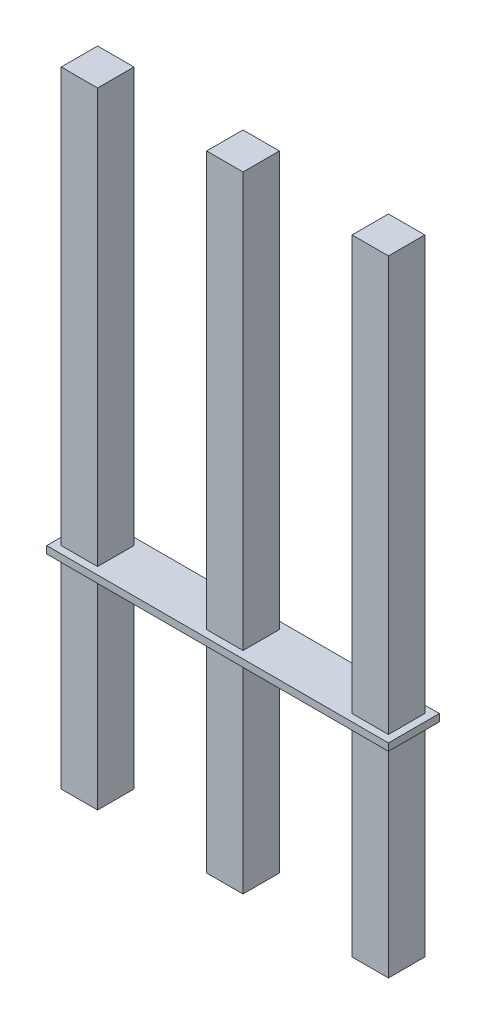
ISO-10303-21;
HEADER;
FILE_DESCRIPTION(('STEP AP214'),'2;1');
FILE_NAME('part.step','',(''),(''),'','','');
FILE_SCHEMA(('AUTOMOTIVE_DESIGN { 1 0 10303 214 1 1 1 1 }'));
ENDSEC;
DATA;
#1=APPLICATION_CONTEXT('core data for automotive mechanical design processes');
#2=APPLICATION_PROTOCOL_DEFINITION('international standard','automotive_design',2000,#1);
#3=PRODUCT_CONTEXT('',#1,'mechanical');
#4=PRODUCT('Part','Part','',(#3));
#5=PRODUCT_RELATED_PRODUCT_CATEGORY('part','',(#4));
#6=PRODUCT_DEFINITION_FORMATION('','',#4);
#7=PRODUCT_DEFINITION_CONTEXT('part definition',#1,'design');
#8=PRODUCT_DEFINITION('design','',#6,#7);
#9=PRODUCT_DEFINITION_SHAPE('','',#8);
#10=(LENGTH_UNIT() NAMED_UNIT(*) SI_UNIT(.MILLI.,.METRE.));
#11=(NAMED_UNIT(*) PLANE_ANGLE_UNIT() SI_UNIT($,.RADIAN.));
#12=(NAMED_UNIT(*) SI_UNIT($,.STERADIAN.) SOLID_ANGLE_UNIT());
#13=UNCERTAINTY_MEASURE_WITH_UNIT(LENGTH_MEASURE(1.E-05),#10,'distance_accuracy_value','');
#14=(GEOMETRIC_REPRESENTATION_CONTEXT(3) GLOBAL_UNCERTAINTY_ASSIGNED_CONTEXT((#13)) GLOBAL_UNIT_ASSIGNED_CONTEXT((#10,
#11,#12)) REPRESENTATION_CONTEXT('',''));
#15=CARTESIAN_POINT('',(0.,0.,0.));
#16=DIRECTION('',(0.,0.,1.));
#17=DIRECTION('',(1.,0.,0.));
#18=AXIS2_PLACEMENT_3D('',#15,#16,#17);
#19=CARTESIAN_POINT('',(2.2225,-7.366,2.54));
#20=DIRECTION('',(-1.,0.,0.));
#21=DIRECTION('',(0.,0.,1.));
#22=AXIS2_PLACEMENT_3D('',#19,#20,#21);
#23=PLANE('',#22);
#24=DIRECTION('',(0.,-1.,0.));
#25=VECTOR('',#24,1.);
#26=CARTESIAN_POINT('',(2.2225,0.,-0.3175));
#27=LINE('',#26,#25);
#28=CARTESIAN_POINT('',(2.2225,3.556,-0.3175));
#29=VERTEX_POINT('',#28);
#30=CARTESIAN_POINT('',(2.2225,0.,-0.3175));
#31=VERTEX_POINT('',#30);
#32=EDGE_CURVE('E10',#29,#31,#27,.T.);
#33=ORIENTED_EDGE('',*,*,#32,.T.);
#34=DIRECTION('',(0.,0.,1.));
#35=VECTOR('',#34,1.);
#36=CARTESIAN_POINT('',(2.2225,0.,0.3175));
#37=LINE('',#36,#35);
#38=CARTESIAN_POINT('',(2.2225,0.,0.3175));
#39=VERTEX_POINT('',#38);
#40=EDGE_CURVE('E24',#31,#39,#37,.T.);
#41=ORIENTED_EDGE('',*,*,#40,.T.);
#42=DIRECTION('',(0.,-1.,0.));
#43=VECTOR('',#42,1.);
#44=CARTESIAN_POINT('',(2.2225,0.,0.3175));
#45=LINE('',#44,#43);
#46=CARTESIAN_POINT('',(2.2225,3.556,0.3175));
#47=VERTEX_POINT('',#46);
#48=EDGE_CURVE('E581',#47,#39,#45,.T.);
#49=ORIENTED_EDGE('',*,*,#48,.F.);
#50=DIRECTION('',(0.,0.,-1.));
#51=VECTOR('',#50,1.);
#52=CARTESIAN_POINT('',(2.2225,3.556,2.54));
#53=LINE('',#52,#51);
#54=EDGE_CURVE('E577',#47,#29,#53,.T.);
#55=ORIENTED_EDGE('',*,*,#54,.T.);
#56=EDGE_LOOP('',(#33,#41,#49,#55));
#57=FACE_BOUND('',#56,.T.);
#58=ADVANCED_FACE('F16',(#57),#23,.T.);
#59=CARTESIAN_POINT('',(2.9845,3.556,0.4445));
#60=DIRECTION('',(0.,1.,0.));
#61=DIRECTION('',(0.,0.,1.));
#62=AXIS2_PLACEMENT_3D('',#59,#60,#61);
#63=PLANE('',#62);
#64=DIRECTION('',(-1.,0.,0.));
#65=VECTOR('',#64,1.);
#66=CARTESIAN_POINT('',(0.,3.556,0.3175));
#67=LINE('',#66,#65);
#68=CARTESIAN_POINT('',(-2.2225,3.556,0.3175));
#69=VERTEX_POINT('',#68);
#70=CARTESIAN_POINT('',(-2.8575,3.556,0.3175));
#71=VERTEX_POINT('',#70);
#72=EDGE_CURVE('E572',#69,#71,#67,.T.);
#73=ORIENTED_EDGE('',*,*,#72,.F.);
#74=DIRECTION('',(0.,0.,-1.));
#75=VECTOR('',#74,1.);
#76=CARTESIAN_POINT('',(-2.2225,3.556,2.54));
#77=LINE('',#76,#75);
#78=CARTESIAN_POINT('',(-2.2225,3.556,-0.3175));
#79=VERTEX_POINT('',#78);
#80=EDGE_CURVE('E568',#69,#79,#77,.T.);
#81=ORIENTED_EDGE('',*,*,#80,.T.);
#82=DIRECTION('',(-1.,0.,0.));
#83=VECTOR('',#82,1.);
#84=CARTESIAN_POINT('',(0.,3.556,-0.3175));
#85=LINE('',#84,#83);
#86=CARTESIAN_POINT('',(-2.8575,3.556,-0.3175));
#87=VERTEX_POINT('',#86);
#88=EDGE_CURVE('E219',#79,#87,#85,.T.);
#89=ORIENTED_EDGE('',*,*,#88,.T.);
#90=DIRECTION('',(0.,0.,1.));
#91=VECTOR('',#90,1.);
#92=CARTESIAN_POINT('',(-2.8575,3.556,0.3175));
#93=LINE('',#92,#91);
#94=EDGE_CURVE('E561',#87,#71,#93,.T.);
#95=ORIENTED_EDGE('',*,*,#94,.T.);
#96=EDGE_LOOP('',(#73,#81,#89,#95));
#97=FACE_BOUND('',#96,.T.);
#98=DIRECTION('',(-1.,0.,0.));
#99=VECTOR('',#98,1.);
#100=CARTESIAN_POINT('',(0.,3.556,-0.3175));
#101=LINE('',#100,#99);
#102=CARTESIAN_POINT('',(2.8575,3.556,-0.3175));
#103=VERTEX_POINT('',#102);
#104=EDGE_CURVE('E556',#103,#29,#101,.T.);
#105=ORIENTED_EDGE('',*,*,#104,.T.);
#106=ORIENTED_EDGE('',*,*,#54,.F.);
#107=DIRECTION('',(-1.,0.,0.));
#108=VECTOR('',#107,1.);
#109=CARTESIAN_POINT('',(0.,3.556,0.3175));
#110=LINE('',#109,#108);
#111=CARTESIAN_POINT('',(2.8575,3.556,0.3175));
#112=VERTEX_POINT('',#111);
#113=EDGE_CURVE('E551',#112,#47,#110,.T.);
#114=ORIENTED_EDGE('',*,*,#113,.F.);
#115=DIRECTION('',(0.,0.,-1.));
#116=VECTOR('',#115,1.);
#117=CARTESIAN_POINT('',(2.8575,3.556,0.3175));
#118=LINE('',#117,#116);
#119=EDGE_CURVE('E547',#112,#103,#118,.T.);
#120=ORIENTED_EDGE('',*,*,#119,.T.);
#121=EDGE_LOOP('',(#105,#106,#114,#120));
#122=FACE_BOUND('',#121,.T.);
#123=DIRECTION('',(-1.,0.,0.));
#124=VECTOR('',#123,1.);
#125=CARTESIAN_POINT('',(0.,3.556,0.3175));
#126=LINE('',#125,#124);
#127=CARTESIAN_POINT('',(0.3175,3.556,0.3175));
#128=VERTEX_POINT('',#127);
#129=CARTESIAN_POINT('',(-0.3175,3.556,0.3175));
#130=VERTEX_POINT('',#129);
#131=EDGE_CURVE('E542',#128,#130,#126,.T.);
#132=ORIENTED_EDGE('',*,*,#131,.F.);
#133=DIRECTION('',(0.,0.,-1.));
#134=VECTOR('',#133,1.);
#135=CARTESIAN_POINT('',(0.3175,3.556,2.54));
#136=LINE('',#135,#134);
#137=CARTESIAN_POINT('',(0.3175,3.556,-0.3175));
#138=VERTEX_POINT('',#137);
#139=EDGE_CURVE('E538',#128,#138,#136,.T.);
#140=ORIENTED_EDGE('',*,*,#139,.T.);
#141=DIRECTION('',(-1.,0.,0.));
#142=VECTOR('',#141,1.);
#143=CARTESIAN_POINT('',(0.,3.556,-0.3175));
#144=LINE('',#143,#142);
#145=CARTESIAN_POINT('',(-0.3175,3.556,-0.3175));
#146=VERTEX_POINT('',#145);
#147=EDGE_CURVE('E534',#138,#146,#144,.T.);
#148=ORIENTED_EDGE('',*,*,#147,.T.);
#149=DIRECTION('',(0.,0.,-1.));
#150=VECTOR('',#149,1.);
#151=CARTESIAN_POINT('',(-0.3175,3.556,2.54));
#152=LINE('',#151,#150);
#153=EDGE_CURVE('E529',#130,#146,#152,.T.);
#154=ORIENTED_EDGE('',*,*,#153,.F.);
#155=EDGE_LOOP('',(#132,#140,#148,#154));
#156=FACE_BOUND('',#155,.T.);
#157=DIRECTION('',(0.,0.,-1.));
#158=VECTOR('',#157,1.);
#159=CARTESIAN_POINT('',(-2.9845,3.556,0.4445));
#160=LINE('',#159,#158);
#161=CARTESIAN_POINT('',(-2.9845,3.556,0.4445));
#162=VERTEX_POINT('',#161);
#163=CARTESIAN_POINT('',(-2.9845,3.556,-0.4445));
#164=VERTEX_POINT('',#163);
#165=EDGE_CURVE('E525',#162,#164,#160,.T.);
#166=ORIENTED_EDGE('',*,*,#165,.T.);
#167=DIRECTION('',(-1.,0.,0.));
#168=VECTOR('',#167,1.);
#169=CARTESIAN_POINT('',(2.9845,3.556,-0.4445));
#170=LINE('',#169,#168);
#171=CARTESIAN_POINT('',(2.9845,3.556,-0.4445));
#172=VERTEX_POINT('',#171);
#173=EDGE_CURVE('E520',#172,#164,#170,.T.);
#174=ORIENTED_EDGE('',*,*,#173,.F.);
#175=DIRECTION('',(0.,0.,-1.));
#176=VECTOR('',#175,1.);
#177=CARTESIAN_POINT('',(2.9845,3.556,0.4445));
#178=LINE('',#177,#176);
#179=CARTESIAN_POINT('',(2.9845,3.556,0.4445));
#180=VERTEX_POINT('',#179);
#181=EDGE_CURVE('E515',#180,#172,#178,.T.);
#182=ORIENTED_EDGE('',*,*,#181,.F.);
#183=DIRECTION('',(-1.,0.,0.));
#184=VECTOR('',#183,1.);
#185=CARTESIAN_POINT('',(2.9845,3.556,0.4445));
#186=LINE('',#185,#184);
#187=EDGE_CURVE('E511',#180,#162,#186,.T.);
#188=ORIENTED_EDGE('',*,*,#187,.T.);
#189=EDGE_LOOP('',(#166,#174,#182,#188));
#190=FACE_BOUND('',#189,.T.);
#191=ADVANCED_FACE('F594',(#97,#122,#156,#190),#63,.F.);
#192=CARTESIAN_POINT('',(2.9845,3.683,0.4445));
#193=DIRECTION('',(0.,0.,-1.));
#194=DIRECTION('',(-1.,0.,0.));
#195=AXIS2_PLACEMENT_3D('',#192,#193,#194);
#196=PLANE('',#195);
#197=DIRECTION('',(0.,-1.,0.));
#198=VECTOR('',#197,1.);
#199=CARTESIAN_POINT('',(-2.9845,3.683,0.4445));
#200=LINE('',#199,#198);
#201=CARTESIAN_POINT('',(-2.9845,3.683,0.4445));
#202=VERTEX_POINT('',#201);
#203=EDGE_CURVE('E506',#202,#162,#200,.T.);
#204=ORIENTED_EDGE('',*,*,#203,.T.);
#205=ORIENTED_EDGE('',*,*,#187,.F.);
#206=DIRECTION('',(0.,-1.,0.));
#207=VECTOR('',#206,1.);
#208=CARTESIAN_POINT('',(2.9845,3.683,0.4445));
#209=LINE('',#208,#207);
#210=CARTESIAN_POINT('',(2.9845,3.683,0.4445));
#211=VERTEX_POINT('',#210);
#212=EDGE_CURVE('E501',#211,#180,#209,.T.);
#213=ORIENTED_EDGE('',*,*,#212,.F.);
#214=DIRECTION('',(-1.,0.,0.));
#215=VECTOR('',#214,1.);
#216=CARTESIAN_POINT('',(2.9845,3.683,0.4445));
#217=LINE('',#216,#215);
#218=EDGE_CURVE('E497',#211,#202,#217,.T.);
#219=ORIENTED_EDGE('',*,*,#218,.T.);
#220=EDGE_LOOP('',(#204,#205,#213,#219));
#221=FACE_BOUND('',#220,.T.);
#222=ADVANCED_FACE('F622',(#221),#196,.F.);
#223=CARTESIAN_POINT('',(2.9845,3.683,-0.4445));
#224=DIRECTION('',(0.,-1.,0.));
#225=DIRECTION('',(0.,0.,-1.));
#226=AXIS2_PLACEMENT_3D('',#223,#224,#225);
#227=PLANE('',#226);
#228=DIRECTION('',(0.,0.,-1.));
#229=VECTOR('',#228,1.);
#230=CARTESIAN_POINT('',(-2.2225,3.683,2.54));
#231=LINE('',#230,#229);
#232=CARTESIAN_POINT('',(-2.2225,3.683,0.3175));
#233=VERTEX_POINT('',#232);
#234=CARTESIAN_POINT('',(-2.2225,3.683,-0.3175));
#235=VERTEX_POINT('',#234);
#236=EDGE_CURVE('E492',#233,#235,#231,.T.);
#237=ORIENTED_EDGE('',*,*,#236,.F.);
#238=DIRECTION('',(1.,0.,0.));
#239=VECTOR('',#238,1.);
#240=CARTESIAN_POINT('',(0.,3.683,0.3175));
#241=LINE('',#240,#239);
#242=CARTESIAN_POINT('',(-2.8575,3.683,0.3175));
#243=VERTEX_POINT('',#242);
#244=EDGE_CURVE('E487',#243,#233,#241,.T.);
#245=ORIENTED_EDGE('',*,*,#244,.F.);
#246=DIRECTION('',(0.,0.,-1.));
#247=VECTOR('',#246,1.);
#248=CARTESIAN_POINT('',(-2.8575,3.683,0.3175));
#249=LINE('',#248,#247);
#250=CARTESIAN_POINT('',(-2.8575,3.683,-0.3175));
#251=VERTEX_POINT('',#250);
#252=EDGE_CURVE('E483',#243,#251,#249,.T.);
#253=ORIENTED_EDGE('',*,*,#252,.T.);
#254=DIRECTION('',(1.,0.,0.));
#255=VECTOR('',#254,1.);
#256=CARTESIAN_POINT('',(0.,3.683,-0.3175));
#257=LINE('',#256,#255);
#258=EDGE_CURVE('E479',#251,#235,#257,.T.);
#259=ORIENTED_EDGE('',*,*,#258,.T.);
#260=EDGE_LOOP('',(#237,#245,#253,#259));
#261=FACE_BOUND('',#260,.T.);
#262=DIRECTION('',(0.,0.,-1.));
#263=VECTOR('',#262,1.);
#264=CARTESIAN_POINT('',(0.3175,3.683,2.54));
#265=LINE('',#264,#263);
#266=CARTESIAN_POINT('',(0.3175,3.683,0.3175));
#267=VERTEX_POINT('',#266);
#268=CARTESIAN_POINT('',(0.3175,3.683,-0.3175));
#269=VERTEX_POINT('',#268);
#270=EDGE_CURVE('E474',#267,#269,#265,.T.);
#271=ORIENTED_EDGE('',*,*,#270,.F.);
#272=DIRECTION('',(1.,0.,0.));
#273=VECTOR('',#272,1.);
#274=CARTESIAN_POINT('',(0.,3.683,0.3175));
#275=LINE('',#274,#273);
#276=CARTESIAN_POINT('',(-0.3175,3.683,0.3175));
#277=VERTEX_POINT('',#276);
#278=EDGE_CURVE('E469',#277,#267,#275,.T.);
#279=ORIENTED_EDGE('',*,*,#278,.F.);
#280=DIRECTION('',(0.,0.,-1.));
#281=VECTOR('',#280,1.);
#282=CARTESIAN_POINT('',(-0.3175,3.683,2.54));
#283=LINE('',#282,#281);
#284=CARTESIAN_POINT('',(-0.3175,3.683,-0.3175));
#285=VERTEX_POINT('',#284);
#286=EDGE_CURVE('E465',#277,#285,#283,.T.);
#287=ORIENTED_EDGE('',*,*,#286,.T.);
#288=DIRECTION('',(1.,0.,0.));
#289=VECTOR('',#288,1.);
#290=CARTESIAN_POINT('',(0.,3.683,-0.3175));
#291=LINE('',#290,#289);
#292=EDGE_CURVE('E461',#285,#269,#291,.T.);
#293=ORIENTED_EDGE('',*,*,#292,.T.);
#294=EDGE_LOOP('',(#271,#279,#287,#293));
#295=FACE_BOUND('',#294,.T.);
#296=DIRECTION('',(1.,0.,0.));
#297=VECTOR('',#296,1.);
#298=CARTESIAN_POINT('',(0.,3.683,0.3175));
#299=LINE('',#298,#297);
#300=CARTESIAN_POINT('',(2.2225,3.683,0.3175));
#301=VERTEX_POINT('',#300);
#302=CARTESIAN_POINT('',(2.8575,3.683,0.3175));
#303=VERTEX_POINT('',#302);
#304=EDGE_CURVE('E456',#301,#303,#299,.T.);
#305=ORIENTED_EDGE('',*,*,#304,.F.);
#306=DIRECTION('',(0.,0.,-1.));
#307=VECTOR('',#306,1.);
#308=CARTESIAN_POINT('',(2.2225,3.683,2.54));
#309=LINE('',#308,#307);
#310=CARTESIAN_POINT('',(2.2225,3.683,-0.3175));
#311=VERTEX_POINT('',#310);
#312=EDGE_CURVE('E452',#301,#311,#309,.T.);
#313=ORIENTED_EDGE('',*,*,#312,.T.);
#314=DIRECTION('',(1.,0.,0.));
#315=VECTOR('',#314,1.);
#316=CARTESIAN_POINT('',(0.,3.683,-0.3175));
#317=LINE('',#316,#315);
#318=CARTESIAN_POINT('',(2.8575,3.683,-0.3175));
#319=VERTEX_POINT('',#318);
#320=EDGE_CURVE('E448',#311,#319,#317,.T.);
#321=ORIENTED_EDGE('',*,*,#320,.T.);
#322=DIRECTION('',(0.,0.,1.));
#323=VECTOR('',#322,1.);
#324=CARTESIAN_POINT('',(2.8575,3.683,0.3175));
#325=LINE('',#324,#323);
#326=EDGE_CURVE('E444',#319,#303,#325,.T.);
#327=ORIENTED_EDGE('',*,*,#326,.T.);
#328=EDGE_LOOP('',(#305,#313,#321,#327));
#329=FACE_BOUND('',#328,.T.);
#330=DIRECTION('',(-1.,0.,0.));
#331=VECTOR('',#330,1.);
#332=CARTESIAN_POINT('',(2.9845,3.683,-0.4445));
#333=LINE('',#332,#331);
#334=CARTESIAN_POINT('',(2.9845,3.683,-0.4445));
#335=VERTEX_POINT('',#334);
#336=CARTESIAN_POINT('',(-2.9845,3.683,-0.4445));
#337=VERTEX_POINT('',#336);
#338=EDGE_CURVE('E440',#335,#337,#333,.T.);
#339=ORIENTED_EDGE('',*,*,#338,.T.);
#340=DIRECTION('',(0.,0.,1.));
#341=VECTOR('',#340,1.);
#342=CARTESIAN_POINT('',(-2.9845,3.683,-0.4445));
#343=LINE('',#342,#341);
#344=EDGE_CURVE('E435',#337,#202,#343,.T.);
#345=ORIENTED_EDGE('',*,*,#344,.T.);
#346=ORIENTED_EDGE('',*,*,#218,.F.);
#347=DIRECTION('',(0.,0.,1.));
#348=VECTOR('',#347,1.);
#349=CARTESIAN_POINT('',(2.9845,3.683,-0.4445));
#350=LINE('',#349,#348);
#351=EDGE_CURVE('E430',#335,#211,#350,.T.);
#352=ORIENTED_EDGE('',*,*,#351,.F.);
#353=EDGE_LOOP('',(#339,#345,#346,#352));
#354=FACE_BOUND('',#353,.T.);
#355=ADVANCED_FACE('F627',(#261,#295,#329,#354),#227,.F.);
#356=CARTESIAN_POINT('',(2.9845,0.,0.));
#357=DIRECTION('',(1.,0.,0.));
#358=DIRECTION('',(0.,0.,-1.));
#359=AXIS2_PLACEMENT_3D('',#356,#357,#358);
#360=PLANE('',#359);
#361=ORIENTED_EDGE('',*,*,#351,.T.);
#362=ORIENTED_EDGE('',*,*,#212,.T.);
#363=ORIENTED_EDGE('',*,*,#181,.T.);
#364=DIRECTION('',(0.,1.,0.));
#365=VECTOR('',#364,1.);
#366=CARTESIAN_POINT('',(2.9845,3.556,-0.4445));
#367=LINE('',#366,#365);
#368=EDGE_CURVE('E425',#172,#335,#367,.T.);
#369=ORIENTED_EDGE('',*,*,#368,.T.);
#370=EDGE_LOOP('',(#361,#362,#363,#369));
#371=FACE_BOUND('',#370,.T.);
#372=ADVANCED_FACE('F633',(#371),#360,.T.);
#373=CARTESIAN_POINT('',(2.9845,3.556,-0.4445));
#374=DIRECTION('',(0.,0.,1.));
#375=DIRECTION('',(1.,0.,0.));
#376=AXIS2_PLACEMENT_3D('',#373,#374,#375);
#377=PLANE('',#376);
#378=DIRECTION('',(0.,1.,0.));
#379=VECTOR('',#378,1.);
#380=CARTESIAN_POINT('',(-2.9845,3.556,-0.4445));
#381=LINE('',#380,#379);
#382=EDGE_CURVE('E420',#164,#337,#381,.T.);
#383=ORIENTED_EDGE('',*,*,#382,.T.);
#384=ORIENTED_EDGE('',*,*,#338,.F.);
#385=ORIENTED_EDGE('',*,*,#368,.F.);
#386=ORIENTED_EDGE('',*,*,#173,.T.);
#387=EDGE_LOOP('',(#383,#384,#385,#386));
#388=FACE_BOUND('',#387,.T.);
#389=ADVANCED_FACE('F637',(#388),#377,.F.);
#390=CARTESIAN_POINT('',(-2.9845,0.,0.));
#391=DIRECTION('',(1.,0.,0.));
#392=DIRECTION('',(0.,0.,-1.));
#393=AXIS2_PLACEMENT_3D('',#390,#391,#392);
#394=PLANE('',#393);
#395=ORIENTED_EDGE('',*,*,#344,.F.);
#396=ORIENTED_EDGE('',*,*,#382,.F.);
#397=ORIENTED_EDGE('',*,*,#165,.F.);
#398=ORIENTED_EDGE('',*,*,#203,.F.);
#399=EDGE_LOOP('',(#395,#396,#397,#398));
#400=FACE_BOUND('',#399,.T.);
#401=ADVANCED_FACE('F641',(#400),#394,.F.);
#402=CARTESIAN_POINT('',(2.8575,0.,0.3175));
#403=DIRECTION('',(-1.,0.,0.));
#404=DIRECTION('',(0.,0.,1.));
#405=AXIS2_PLACEMENT_3D('',#402,#403,#404);
#406=PLANE('',#405);
#407=ORIENTED_EDGE('',*,*,#326,.F.);
#408=DIRECTION('',(0.,1.,0.));
#409=VECTOR('',#408,1.);
#410=CARTESIAN_POINT('',(2.8575,0.,-0.3175));
#411=LINE('',#410,#409);
#412=CARTESIAN_POINT('',(2.8575,10.922,-0.3175));
#413=VERTEX_POINT('',#412);
#414=EDGE_CURVE('E416',#319,#413,#411,.T.);
#415=ORIENTED_EDGE('',*,*,#414,.T.);
#416=DIRECTION('',(0.,0.,-1.));
#417=VECTOR('',#416,1.);
#418=CARTESIAN_POINT('',(2.8575,10.922,0.3175));
#419=LINE('',#418,#417);
#420=CARTESIAN_POINT('',(2.8575,10.922,0.3175));
#421=VERTEX_POINT('',#420);
#422=EDGE_CURVE('E411',#421,#413,#419,.T.);
#423=ORIENTED_EDGE('',*,*,#422,.F.);
#424=DIRECTION('',(0.,1.,0.));
#425=VECTOR('',#424,1.);
#426=CARTESIAN_POINT('',(2.8575,0.,0.3175));
#427=LINE('',#426,#425);
#428=EDGE_CURVE('E406',#303,#421,#427,.T.);
#429=ORIENTED_EDGE('',*,*,#428,.F.);
#430=EDGE_LOOP('',(#407,#415,#423,#429));
#431=FACE_BOUND('',#430,.T.);
#432=ADVANCED_FACE('F645',(#431),#406,.F.);
#433=CARTESIAN_POINT('',(0.,0.,0.3175));
#434=DIRECTION('',(0.,0.,1.));
#435=DIRECTION('',(1.,0.,0.));
#436=AXIS2_PLACEMENT_3D('',#433,#434,#435);
#437=PLANE('',#436);
#438=DIRECTION('',(-1.,0.,0.));
#439=VECTOR('',#438,1.);
#440=CARTESIAN_POINT('',(2.8575,10.922,0.3175));
#441=LINE('',#440,#439);
#442=CARTESIAN_POINT('',(2.2225,10.922,0.3175));
#443=VERTEX_POINT('',#442);
#444=EDGE_CURVE('E402',#421,#443,#441,.T.);
#445=ORIENTED_EDGE('',*,*,#444,.T.);
#446=DIRECTION('',(0.,-1.,0.));
#447=VECTOR('',#446,1.);
#448=CARTESIAN_POINT('',(2.2225,0.,0.3175));
#449=LINE('',#448,#447);
#450=EDGE_CURVE('E397',#443,#301,#449,.T.);
#451=ORIENTED_EDGE('',*,*,#450,.T.);
#452=ORIENTED_EDGE('',*,*,#304,.T.);
#453=ORIENTED_EDGE('',*,*,#428,.T.);
#454=EDGE_LOOP('',(#445,#451,#452,#453));
#455=FACE_BOUND('',#454,.T.);
#456=ADVANCED_FACE('F649',(#455),#437,.T.);
#457=CARTESIAN_POINT('',(2.2225,3.683,2.54));
#458=DIRECTION('',(-1.,0.,0.));
#459=DIRECTION('',(0.,0.,1.));
#460=AXIS2_PLACEMENT_3D('',#457,#458,#459);
#461=PLANE('',#460);
#462=DIRECTION('',(0.,0.,-1.));
#463=VECTOR('',#462,1.);
#464=CARTESIAN_POINT('',(2.2225,10.922,0.3175));
#465=LINE('',#464,#463);
#466=CARTESIAN_POINT('',(2.2225,10.922,-0.3175));
#467=VERTEX_POINT('',#466);
#468=EDGE_CURVE('E393',#443,#467,#465,.T.);
#469=ORIENTED_EDGE('',*,*,#468,.T.);
#470=DIRECTION('',(0.,-1.,0.));
#471=VECTOR('',#470,1.);
#472=CARTESIAN_POINT('',(2.2225,0.,-0.3175));
#473=LINE('',#472,#471);
#474=EDGE_CURVE('E388',#467,#311,#473,.T.);
#475=ORIENTED_EDGE('',*,*,#474,.T.);
#476=ORIENTED_EDGE('',*,*,#312,.F.);
#477=ORIENTED_EDGE('',*,*,#450,.F.);
#478=EDGE_LOOP('',(#469,#475,#476,#477));
#479=FACE_BOUND('',#478,.T.);
#480=ADVANCED_FACE('F653',(#479),#461,.T.);
#481=CARTESIAN_POINT('',(0.,0.,-0.3175));
#482=DIRECTION('',(0.,0.,1.));
#483=DIRECTION('',(1.,0.,0.));
#484=AXIS2_PLACEMENT_3D('',#481,#482,#483);
#485=PLANE('',#484);
#486=ORIENTED_EDGE('',*,*,#474,.F.);
#487=DIRECTION('',(-1.,0.,0.));
#488=VECTOR('',#487,1.);
#489=CARTESIAN_POINT('',(2.8575,10.922,-0.3175));
#490=LINE('',#489,#488);
#491=EDGE_CURVE('E383',#413,#467,#490,.T.);
#492=ORIENTED_EDGE('',*,*,#491,.F.);
#493=ORIENTED_EDGE('',*,*,#414,.F.);
#494=ORIENTED_EDGE('',*,*,#320,.F.);
#495=EDGE_LOOP('',(#486,#492,#493,#494));
#496=FACE_BOUND('',#495,.T.);
#497=ADVANCED_FACE('F657',(#496),#485,.F.);
#498=CARTESIAN_POINT('',(2.8575,10.922,0.3175));
#499=DIRECTION('',(0.,-1.,0.));
#500=DIRECTION('',(0.,0.,-1.));
#501=AXIS2_PLACEMENT_3D('',#498,#499,#500);
#502=PLANE('',#501);
#503=ORIENTED_EDGE('',*,*,#468,.F.);
#504=ORIENTED_EDGE('',*,*,#444,.F.);
#505=ORIENTED_EDGE('',*,*,#422,.T.);
#506=ORIENTED_EDGE('',*,*,#491,.T.);
#507=EDGE_LOOP('',(#503,#504,#505,#506));
#508=FACE_BOUND('',#507,.T.);
#509=ADVANCED_FACE('F661',(#508),#502,.F.);
#510=CARTESIAN_POINT('',(0.,0.,-0.3175));
#511=DIRECTION('',(0.,0.,1.));
#512=DIRECTION('',(1.,0.,0.));
#513=AXIS2_PLACEMENT_3D('',#510,#511,#512);
#514=PLANE('',#513);
#515=DIRECTION('',(0.,-1.,0.));
#516=VECTOR('',#515,1.);
#517=CARTESIAN_POINT('',(-0.3175,0.,-0.3175));
#518=LINE('',#517,#516);
#519=CARTESIAN_POINT('',(-0.3175,10.922,-0.3175));
#520=VERTEX_POINT('',#519);
#521=EDGE_CURVE('E378',#520,#285,#518,.T.);
#522=ORIENTED_EDGE('',*,*,#521,.F.);
#523=DIRECTION('',(-1.,0.,0.));
#524=VECTOR('',#523,1.);
#525=CARTESIAN_POINT('',(2.8575,10.922,-0.3175));
#526=LINE('',#525,#524);
#527=CARTESIAN_POINT('',(0.3175,10.922,-0.3175));
#528=VERTEX_POINT('',#527);
#529=EDGE_CURVE('E373',#528,#520,#526,.T.);
#530=ORIENTED_EDGE('',*,*,#529,.F.);
#531=DIRECTION('',(0.,1.,0.));
#532=VECTOR('',#531,1.);
#533=CARTESIAN_POINT('',(0.3175,0.,-0.3175));
#534=LINE('',#533,#532);
#535=EDGE_CURVE('E368',#269,#528,#534,.T.);
#536=ORIENTED_EDGE('',*,*,#535,.F.);
#537=ORIENTED_EDGE('',*,*,#292,.F.);
#538=EDGE_LOOP('',(#522,#530,#536,#537));
#539=FACE_BOUND('',#538,.T.);
#540=ADVANCED_FACE('F665',(#539),#514,.F.);
#541=CARTESIAN_POINT('',(0.3175,10.922,2.54));
#542=DIRECTION('',(1.,0.,0.));
#543=DIRECTION('',(0.,0.,-1.));
#544=AXIS2_PLACEMENT_3D('',#541,#542,#543);
#545=PLANE('',#544);
#546=ORIENTED_EDGE('',*,*,#270,.T.);
#547=ORIENTED_EDGE('',*,*,#535,.T.);
#548=DIRECTION('',(0.,0.,-1.));
#549=VECTOR('',#548,1.);
#550=CARTESIAN_POINT('',(0.3175,10.922,2.54));
#551=LINE('',#550,#549);
#552=CARTESIAN_POINT('',(0.3175,10.922,0.3175));
#553=VERTEX_POINT('',#552);
#554=EDGE_CURVE('E363',#553,#528,#551,.T.);
#555=ORIENTED_EDGE('',*,*,#554,.F.);
#556=DIRECTION('',(0.,1.,0.));
#557=VECTOR('',#556,1.);
#558=CARTESIAN_POINT('',(0.3175,0.,0.3175));
#559=LINE('',#558,#557);
#560=EDGE_CURVE('E358',#267,#553,#559,.T.);
#561=ORIENTED_EDGE('',*,*,#560,.F.);
#562=EDGE_LOOP('',(#546,#547,#555,#561));
#563=FACE_BOUND('',#562,.T.);
#564=ADVANCED_FACE('F669',(#563),#545,.T.);
#565=CARTESIAN_POINT('',(0.,0.,0.3175));
#566=DIRECTION('',(0.,0.,1.));
#567=DIRECTION('',(1.,0.,0.));
#568=AXIS2_PLACEMENT_3D('',#565,#566,#567);
#569=PLANE('',#568);
#570=DIRECTION('',(-1.,0.,0.));
#571=VECTOR('',#570,1.);
#572=CARTESIAN_POINT('',(2.8575,10.922,0.3175));
#573=LINE('',#572,#571);
#574=CARTESIAN_POINT('',(-0.3175,10.922,0.3175));
#575=VERTEX_POINT('',#574);
#576=EDGE_CURVE('E354',#553,#575,#573,.T.);
#577=ORIENTED_EDGE('',*,*,#576,.T.);
#578=DIRECTION('',(0.,-1.,0.));
#579=VECTOR('',#578,1.);
#580=CARTESIAN_POINT('',(-0.3175,0.,0.3175));
#581=LINE('',#580,#579);
#582=EDGE_CURVE('E349',#575,#277,#581,.T.);
#583=ORIENTED_EDGE('',*,*,#582,.T.);
#584=ORIENTED_EDGE('',*,*,#278,.T.);
#585=ORIENTED_EDGE('',*,*,#560,.T.);
#586=EDGE_LOOP('',(#577,#583,#584,#585));
#587=FACE_BOUND('',#586,.T.);
#588=ADVANCED_FACE('F673',(#587),#569,.T.);
#589=CARTESIAN_POINT('',(-0.3175,3.683,2.54));
#590=DIRECTION('',(-1.,0.,0.));
#591=DIRECTION('',(0.,0.,1.));
#592=AXIS2_PLACEMENT_3D('',#589,#590,#591);
#593=PLANE('',#592);
#594=DIRECTION('',(0.,0.,-1.));
#595=VECTOR('',#594,1.);
#596=CARTESIAN_POINT('',(-0.3175,10.922,2.54));
#597=LINE('',#596,#595);
#598=EDGE_CURVE('E344',#575,#520,#597,.T.);
#599=ORIENTED_EDGE('',*,*,#598,.T.);
#600=ORIENTED_EDGE('',*,*,#521,.T.);
#601=ORIENTED_EDGE('',*,*,#286,.F.);
#602=ORIENTED_EDGE('',*,*,#582,.F.);
#603=EDGE_LOOP('',(#599,#600,#601,#602));
#604=FACE_BOUND('',#603,.T.);
#605=ADVANCED_FACE('F677',(#604),#593,.T.);
#606=CARTESIAN_POINT('',(2.8575,10.922,0.3175));
#607=DIRECTION('',(0.,-1.,0.));
#608=DIRECTION('',(0.,0.,-1.));
#609=AXIS2_PLACEMENT_3D('',#606,#607,#608);
#610=PLANE('',#609);
#611=ORIENTED_EDGE('',*,*,#598,.F.);
#612=ORIENTED_EDGE('',*,*,#576,.F.);
#613=ORIENTED_EDGE('',*,*,#554,.T.);
#614=ORIENTED_EDGE('',*,*,#529,.T.);
#615=EDGE_LOOP('',(#611,#612,#613,#614));
#616=FACE_BOUND('',#615,.T.);
#617=ADVANCED_FACE('F681',(#616),#610,.F.);
#618=CARTESIAN_POINT('',(0.,0.,-0.3175));
#619=DIRECTION('',(0.,0.,1.));
#620=DIRECTION('',(1.,0.,0.));
#621=AXIS2_PLACEMENT_3D('',#618,#619,#620);
#622=PLANE('',#621);
#623=DIRECTION('',(0.,1.,0.));
#624=VECTOR('',#623,1.);
#625=CARTESIAN_POINT('',(-2.2225,0.,-0.3175));
#626=LINE('',#625,#624);
#627=CARTESIAN_POINT('',(-2.2225,10.922,-0.3175));
#628=VERTEX_POINT('',#627);
#629=EDGE_CURVE('E339',#235,#628,#626,.T.);
#630=ORIENTED_EDGE('',*,*,#629,.F.);
#631=ORIENTED_EDGE('',*,*,#258,.F.);
#632=DIRECTION('',(0.,-1.,0.));
#633=VECTOR('',#632,1.);
#634=CARTESIAN_POINT('',(-2.8575,10.922,-0.3175));
#635=LINE('',#634,#633);
#636=CARTESIAN_POINT('',(-2.8575,10.922,-0.3175));
#637=VERTEX_POINT('',#636);
#638=EDGE_CURVE('E334',#637,#251,#635,.T.);
#639=ORIENTED_EDGE('',*,*,#638,.F.);
#640=DIRECTION('',(-1.,0.,0.));
#641=VECTOR('',#640,1.);
#642=CARTESIAN_POINT('',(2.8575,10.922,-0.3175));
#643=LINE('',#642,#641);
#644=EDGE_CURVE('E329',#628,#637,#643,.T.);
#645=ORIENTED_EDGE('',*,*,#644,.F.);
#646=EDGE_LOOP('',(#630,#631,#639,#645));
#647=FACE_BOUND('',#646,.T.);
#648=ADVANCED_FACE('F685',(#647),#622,.F.);
#649=CARTESIAN_POINT('',(2.8575,10.922,0.3175));
#650=DIRECTION('',(0.,-1.,0.));
#651=DIRECTION('',(0.,0.,-1.));
#652=AXIS2_PLACEMENT_3D('',#649,#650,#651);
#653=PLANE('',#652);
#654=DIRECTION('',(0.,0.,1.));
#655=VECTOR('',#654,1.);
#656=CARTESIAN_POINT('',(-2.2225,10.922,0.3175));
#657=LINE('',#656,#655);
#658=CARTESIAN_POINT('',(-2.2225,10.922,0.3175));
#659=VERTEX_POINT('',#658);
#660=EDGE_CURVE('E324',#628,#659,#657,.T.);
#661=ORIENTED_EDGE('',*,*,#660,.F.);
#662=ORIENTED_EDGE('',*,*,#644,.T.);
#663=DIRECTION('',(0.,0.,-1.));
#664=VECTOR('',#663,1.);
#665=CARTESIAN_POINT('',(-2.8575,10.922,0.3175));
#666=LINE('',#665,#664);
#667=CARTESIAN_POINT('',(-2.8575,10.922,0.3175));
#668=VERTEX_POINT('',#667);
#669=EDGE_CURVE('E319',#668,#637,#666,.T.);
#670=ORIENTED_EDGE('',*,*,#669,.F.);
#671=DIRECTION('',(-1.,0.,0.));
#672=VECTOR('',#671,1.);
#673=CARTESIAN_POINT('',(2.8575,10.922,0.3175));
#674=LINE('',#673,#672);
#675=EDGE_CURVE('E314',#659,#668,#674,.T.);
#676=ORIENTED_EDGE('',*,*,#675,.F.);
#677=EDGE_LOOP('',(#661,#662,#670,#676));
#678=FACE_BOUND('',#677,.T.);
#679=ADVANCED_FACE('F689',(#678),#653,.F.);
#680=CARTESIAN_POINT('',(0.,0.,0.3175));
#681=DIRECTION('',(0.,0.,1.));
#682=DIRECTION('',(1.,0.,0.));
#683=AXIS2_PLACEMENT_3D('',#680,#681,#682);
#684=PLANE('',#683);
#685=ORIENTED_EDGE('',*,*,#244,.T.);
#686=DIRECTION('',(0.,1.,0.));
#687=VECTOR('',#686,1.);
#688=CARTESIAN_POINT('',(-2.2225,0.,0.3175));
#689=LINE('',#688,#687);
#690=EDGE_CURVE('E309',#233,#659,#689,.T.);
#691=ORIENTED_EDGE('',*,*,#690,.T.);
#692=ORIENTED_EDGE('',*,*,#675,.T.);
#693=DIRECTION('',(0.,-1.,0.));
#694=VECTOR('',#693,1.);
#695=CARTESIAN_POINT('',(-2.8575,10.922,0.3175));
#696=LINE('',#695,#694);
#697=EDGE_CURVE('E304',#668,#243,#696,.T.);
#698=ORIENTED_EDGE('',*,*,#697,.T.);
#699=EDGE_LOOP('',(#685,#691,#692,#698));
#700=FACE_BOUND('',#699,.T.);
#701=ADVANCED_FACE('F693',(#700),#684,.T.);
#702=CARTESIAN_POINT('',(-2.8575,10.922,0.3175));
#703=DIRECTION('',(1.,0.,0.));
#704=DIRECTION('',(0.,0.,-1.));
#705=AXIS2_PLACEMENT_3D('',#702,#703,#704);
#706=PLANE('',#705);
#707=ORIENTED_EDGE('',*,*,#252,.F.);
#708=ORIENTED_EDGE('',*,*,#697,.F.);
#709=ORIENTED_EDGE('',*,*,#669,.T.);
#710=ORIENTED_EDGE('',*,*,#638,.T.);
#711=EDGE_LOOP('',(#707,#708,#709,#710));
#712=FACE_BOUND('',#711,.T.);
#713=ADVANCED_FACE('F697',(#712),#706,.F.);
#714=CARTESIAN_POINT('',(-2.2225,14.605,2.54));
#715=DIRECTION('',(1.,0.,0.));
#716=DIRECTION('',(0.,0.,-1.));
#717=AXIS2_PLACEMENT_3D('',#714,#715,#716);
#718=PLANE('',#717);
#719=ORIENTED_EDGE('',*,*,#236,.T.);
#720=ORIENTED_EDGE('',*,*,#629,.T.);
#721=ORIENTED_EDGE('',*,*,#660,.T.);
#722=ORIENTED_EDGE('',*,*,#690,.F.);
#723=EDGE_LOOP('',(#719,#720,#721,#722));
#724=FACE_BOUND('',#723,.T.);
#725=ADVANCED_FACE('F701',(#724),#718,.T.);
#726=CARTESIAN_POINT('',(-0.3175,0.,2.54));
#727=DIRECTION('',(-1.,0.,0.));
#728=DIRECTION('',(0.,0.,1.));
#729=AXIS2_PLACEMENT_3D('',#726,#727,#728);
#730=PLANE('',#729);
#731=DIRECTION('',(0.,-1.,0.));
#732=VECTOR('',#731,1.);
#733=CARTESIAN_POINT('',(-0.3175,0.,-0.3175));
#734=LINE('',#733,#732);
#735=CARTESIAN_POINT('',(-0.3175,0.,-0.3175));
#736=VERTEX_POINT('',#735);
#737=EDGE_CURVE('E300',#146,#736,#734,.T.);
#738=ORIENTED_EDGE('',*,*,#737,.T.);
#739=DIRECTION('',(0.,0.,-1.));
#740=VECTOR('',#739,1.);
#741=CARTESIAN_POINT('',(-0.3175,0.,2.54));
#742=LINE('',#741,#740);
#743=CARTESIAN_POINT('',(-0.3175,0.,0.3175));
#744=VERTEX_POINT('',#743);
#745=EDGE_CURVE('E295',#744,#736,#742,.T.);
#746=ORIENTED_EDGE('',*,*,#745,.F.);
#747=DIRECTION('',(0.,-1.,0.));
#748=VECTOR('',#747,1.);
#749=CARTESIAN_POINT('',(-0.3175,0.,0.3175));
#750=LINE('',#749,#748);
#751=EDGE_CURVE('E290',#130,#744,#750,.T.);
#752=ORIENTED_EDGE('',*,*,#751,.F.);
#753=ORIENTED_EDGE('',*,*,#153,.T.);
#754=EDGE_LOOP('',(#738,#746,#752,#753));
#755=FACE_BOUND('',#754,.T.);
#756=ADVANCED_FACE('F705',(#755),#730,.T.);
#757=CARTESIAN_POINT('',(0.,0.,0.3175));
#758=DIRECTION('',(0.,0.,1.));
#759=DIRECTION('',(1.,0.,0.));
#760=AXIS2_PLACEMENT_3D('',#757,#758,#759);
#761=PLANE('',#760);
#762=DIRECTION('',(1.,0.,0.));
#763=VECTOR('',#762,1.);
#764=CARTESIAN_POINT('',(-2.8575,0.,0.3175));
#765=LINE('',#764,#763);
#766=CARTESIAN_POINT('',(0.3175,0.,0.3175));
#767=VERTEX_POINT('',#766);
#768=EDGE_CURVE('E286',#744,#767,#765,.T.);
#769=ORIENTED_EDGE('',*,*,#768,.T.);
#770=DIRECTION('',(0.,1.,0.));
#771=VECTOR('',#770,1.);
#772=CARTESIAN_POINT('',(0.3175,0.,0.3175));
#773=LINE('',#772,#771);
#774=EDGE_CURVE('E281',#767,#128,#773,.T.);
#775=ORIENTED_EDGE('',*,*,#774,.T.);
#776=ORIENTED_EDGE('',*,*,#131,.T.);
#777=ORIENTED_EDGE('',*,*,#751,.T.);
#778=EDGE_LOOP('',(#769,#775,#776,#777));
#779=FACE_BOUND('',#778,.T.);
#780=ADVANCED_FACE('F709',(#779),#761,.T.);
#781=CARTESIAN_POINT('',(0.3175,3.556,2.54));
#782=DIRECTION('',(1.,0.,0.));
#783=DIRECTION('',(0.,0.,-1.));
#784=AXIS2_PLACEMENT_3D('',#781,#782,#783);
#785=PLANE('',#784);
#786=DIRECTION('',(0.,1.,0.));
#787=VECTOR('',#786,1.);
#788=CARTESIAN_POINT('',(0.3175,0.,-0.3175));
#789=LINE('',#788,#787);
#790=CARTESIAN_POINT('',(0.3175,0.,-0.3175));
#791=VERTEX_POINT('',#790);
#792=EDGE_CURVE('E276',#791,#138,#789,.T.);
#793=ORIENTED_EDGE('',*,*,#792,.T.);
#794=ORIENTED_EDGE('',*,*,#139,.F.);
#795=ORIENTED_EDGE('',*,*,#774,.F.);
#796=DIRECTION('',(0.,0.,-1.));
#797=VECTOR('',#796,1.);
#798=CARTESIAN_POINT('',(0.3175,0.,2.54));
#799=LINE('',#798,#797);
#800=EDGE_CURVE('E272',#767,#791,#799,.T.);
#801=ORIENTED_EDGE('',*,*,#800,.T.);
#802=EDGE_LOOP('',(#793,#794,#795,#801));
#803=FACE_BOUND('',#802,.T.);
#804=ADVANCED_FACE('F713',(#803),#785,.T.);
#805=CARTESIAN_POINT('',(-2.8575,0.,0.3175));
#806=DIRECTION('',(0.,1.,0.));
#807=DIRECTION('',(0.,0.,1.));
#808=AXIS2_PLACEMENT_3D('',#805,#806,#807);
#809=PLANE('',#808);
#810=ORIENTED_EDGE('',*,*,#800,.F.);
#811=ORIENTED_EDGE('',*,*,#768,.F.);
#812=ORIENTED_EDGE('',*,*,#745,.T.);
#813=DIRECTION('',(1.,0.,0.));
#814=VECTOR('',#813,1.);
#815=CARTESIAN_POINT('',(-2.8575,0.,-0.3175));
#816=LINE('',#815,#814);
#817=EDGE_CURVE('E267',#736,#791,#816,.T.);
#818=ORIENTED_EDGE('',*,*,#817,.T.);
#819=EDGE_LOOP('',(#810,#811,#812,#818));
#820=FACE_BOUND('',#819,.T.);
#821=ADVANCED_FACE('F615',(#820),#809,.F.);
#822=CARTESIAN_POINT('',(0.,0.,-0.3175));
#823=DIRECTION('',(0.,0.,1.));
#824=DIRECTION('',(1.,0.,0.));
#825=AXIS2_PLACEMENT_3D('',#822,#823,#824);
#826=PLANE('',#825);
#827=ORIENTED_EDGE('',*,*,#792,.F.);
#828=ORIENTED_EDGE('',*,*,#817,.F.);
#829=ORIENTED_EDGE('',*,*,#737,.F.);
#830=ORIENTED_EDGE('',*,*,#147,.F.);
#831=EDGE_LOOP('',(#827,#828,#829,#830));
#832=FACE_BOUND('',#831,.T.);
#833=ADVANCED_FACE('F607',(#832),#826,.F.);
#834=CARTESIAN_POINT('',(2.8575,0.,0.3175));
#835=DIRECTION('',(-1.,0.,0.));
#836=DIRECTION('',(0.,0.,1.));
#837=AXIS2_PLACEMENT_3D('',#834,#835,#836);
#838=PLANE('',#837);
#839=ORIENTED_EDGE('',*,*,#119,.F.);
#840=DIRECTION('',(0.,1.,0.));
#841=VECTOR('',#840,1.);
#842=CARTESIAN_POINT('',(2.8575,0.,0.3175));
#843=LINE('',#842,#841);
#844=CARTESIAN_POINT('',(2.8575,0.,0.3175));
#845=VERTEX_POINT('',#844);
#846=EDGE_CURVE('E262',#845,#112,#843,.T.);
#847=ORIENTED_EDGE('',*,*,#846,.F.);
#848=DIRECTION('',(0.,0.,-1.));
#849=VECTOR('',#848,1.);
#850=CARTESIAN_POINT('',(2.8575,0.,0.3175));
#851=LINE('',#850,#849);
#852=CARTESIAN_POINT('',(2.8575,0.,-0.3175));
#853=VERTEX_POINT('',#852);
#854=EDGE_CURVE('E258',#845,#853,#851,.T.);
#855=ORIENTED_EDGE('',*,*,#854,.T.);
#856=DIRECTION('',(0.,1.,0.));
#857=VECTOR('',#856,1.);
#858=CARTESIAN_POINT('',(2.8575,0.,-0.3175));
#859=LINE('',#858,#857);
#860=EDGE_CURVE('E253',#853,#103,#859,.T.);
#861=ORIENTED_EDGE('',*,*,#860,.T.);
#862=EDGE_LOOP('',(#839,#847,#855,#861));
#863=FACE_BOUND('',#862,.T.);
#864=ADVANCED_FACE('F605',(#863),#838,.F.);
#865=CARTESIAN_POINT('',(0.,0.,-0.3175));
#866=DIRECTION('',(0.,0.,1.));
#867=DIRECTION('',(1.,0.,0.));
#868=AXIS2_PLACEMENT_3D('',#865,#866,#867);
#869=PLANE('',#868);
#870=ORIENTED_EDGE('',*,*,#32,.F.);
#871=ORIENTED_EDGE('',*,*,#104,.F.);
#872=ORIENTED_EDGE('',*,*,#860,.F.);
#873=DIRECTION('',(1.,0.,0.));
#874=VECTOR('',#873,1.);
#875=CARTESIAN_POINT('',(-2.8575,0.,-0.3175));
#876=LINE('',#875,#874);
#877=EDGE_CURVE('E248',#31,#853,#876,.T.);
#878=ORIENTED_EDGE('',*,*,#877,.F.);
#879=EDGE_LOOP('',(#870,#871,#872,#878));
#880=FACE_BOUND('',#879,.T.);
#881=ADVANCED_FACE('F600',(#880),#869,.F.);
#882=CARTESIAN_POINT('',(-2.8575,0.,0.3175));
#883=DIRECTION('',(0.,1.,0.));
#884=DIRECTION('',(0.,0.,1.));
#885=AXIS2_PLACEMENT_3D('',#882,#883,#884);
#886=PLANE('',#885);
#887=ORIENTED_EDGE('',*,*,#40,.F.);
#888=ORIENTED_EDGE('',*,*,#877,.T.);
#889=ORIENTED_EDGE('',*,*,#854,.F.);
#890=DIRECTION('',(1.,0.,0.));
#891=VECTOR('',#890,1.);
#892=CARTESIAN_POINT('',(-2.8575,0.,0.3175));
#893=LINE('',#892,#891);
#894=EDGE_CURVE('E243',#39,#845,#893,.T.);
#895=ORIENTED_EDGE('',*,*,#894,.F.);
#896=EDGE_LOOP('',(#887,#888,#889,#895));
#897=FACE_BOUND('',#896,.T.);
#898=ADVANCED_FACE('F603',(#897),#886,.F.);
#899=CARTESIAN_POINT('',(0.,0.,0.3175));
#900=DIRECTION('',(0.,0.,1.));
#901=DIRECTION('',(1.,0.,0.));
#902=AXIS2_PLACEMENT_3D('',#899,#900,#901);
#903=PLANE('',#902);
#904=ORIENTED_EDGE('',*,*,#113,.T.);
#905=ORIENTED_EDGE('',*,*,#48,.T.);
#906=ORIENTED_EDGE('',*,*,#894,.T.);
#907=ORIENTED_EDGE('',*,*,#846,.T.);
#908=EDGE_LOOP('',(#904,#905,#906,#907));
#909=FACE_BOUND('',#908,.T.);
#910=ADVANCED_FACE('F591',(#909),#903,.T.);
#911=CARTESIAN_POINT('',(-2.8575,10.922,0.3175));
#912=DIRECTION('',(1.,0.,0.));
#913=DIRECTION('',(0.,0.,-1.));
#914=AXIS2_PLACEMENT_3D('',#911,#912,#913);
#915=PLANE('',#914);
#916=ORIENTED_EDGE('',*,*,#94,.F.);
#917=DIRECTION('',(0.,-1.,0.));
#918=VECTOR('',#917,1.);
#919=CARTESIAN_POINT('',(-2.8575,10.922,-0.3175));
#920=LINE('',#919,#918);
#921=CARTESIAN_POINT('',(-2.8575,0.,-0.3175));
#922=VERTEX_POINT('',#921);
#923=EDGE_CURVE('E239',#87,#922,#920,.T.);
#924=ORIENTED_EDGE('',*,*,#923,.T.);
#925=DIRECTION('',(0.,0.,-1.));
#926=VECTOR('',#925,1.);
#927=CARTESIAN_POINT('',(-2.8575,0.,0.3175));
#928=LINE('',#927,#926);
#929=CARTESIAN_POINT('',(-2.8575,0.,0.3175));
#930=VERTEX_POINT('',#929);
#931=EDGE_CURVE('E214',#930,#922,#928,.T.);
#932=ORIENTED_EDGE('',*,*,#931,.F.);
#933=DIRECTION('',(0.,-1.,0.));
#934=VECTOR('',#933,1.);
#935=CARTESIAN_POINT('',(-2.8575,10.922,0.3175));
#936=LINE('',#935,#934);
#937=EDGE_CURVE('E231',#71,#930,#936,.T.);
#938=ORIENTED_EDGE('',*,*,#937,.F.);
#939=EDGE_LOOP('',(#916,#924,#932,#938));
#940=FACE_BOUND('',#939,.T.);
#941=ADVANCED_FACE('F779',(#940),#915,.F.);
#942=CARTESIAN_POINT('',(0.,0.,0.3175));
#943=DIRECTION('',(0.,0.,1.));
#944=DIRECTION('',(1.,0.,0.));
#945=AXIS2_PLACEMENT_3D('',#942,#943,#944);
#946=PLANE('',#945);
#947=DIRECTION('',(1.,0.,0.));
#948=VECTOR('',#947,1.);
#949=CARTESIAN_POINT('',(-2.8575,0.,0.3175));
#950=LINE('',#949,#948);
#951=CARTESIAN_POINT('',(-2.2225,0.,0.3175));
#952=VERTEX_POINT('',#951);
#953=EDGE_CURVE('E221',#930,#952,#950,.T.);
#954=ORIENTED_EDGE('',*,*,#953,.T.);
#955=DIRECTION('',(0.,1.,0.));
#956=VECTOR('',#955,1.);
#957=CARTESIAN_POINT('',(-2.2225,0.,0.3175));
#958=LINE('',#957,#956);
#959=EDGE_CURVE('E206',#952,#69,#958,.T.);
#960=ORIENTED_EDGE('',*,*,#959,.T.);
#961=ORIENTED_EDGE('',*,*,#72,.T.);
#962=ORIENTED_EDGE('',*,*,#937,.T.);
#963=EDGE_LOOP('',(#954,#960,#961,#962));
#964=FACE_BOUND('',#963,.T.);
#965=ADVANCED_FACE('F788',(#964),#946,.T.);
#966=CARTESIAN_POINT('',(-2.2225,3.556,2.54));
#967=DIRECTION('',(1.,0.,0.));
#968=DIRECTION('',(0.,0.,-1.));
#969=AXIS2_PLACEMENT_3D('',#966,#967,#968);
#970=PLANE('',#969);
#971=DIRECTION('',(0.,1.,0.));
#972=VECTOR('',#971,1.);
#973=CARTESIAN_POINT('',(-2.2225,0.,-0.3175));
#974=LINE('',#973,#972);
#975=CARTESIAN_POINT('',(-2.2225,0.,-0.3175));
#976=VERTEX_POINT('',#975);
#977=EDGE_CURVE('E203',#976,#79,#974,.T.);
#978=ORIENTED_EDGE('',*,*,#977,.T.);
#979=ORIENTED_EDGE('',*,*,#80,.F.);
#980=ORIENTED_EDGE('',*,*,#959,.F.);
#981=DIRECTION('',(0.,0.,-1.));
#982=VECTOR('',#981,1.);
#983=CARTESIAN_POINT('',(-2.2225,0.,0.3175));
#984=LINE('',#983,#982);
#985=EDGE_CURVE('E198',#952,#976,#984,.T.);
#986=ORIENTED_EDGE('',*,*,#985,.T.);
#987=EDGE_LOOP('',(#978,#979,#980,#986));
#988=FACE_BOUND('',#987,.T.);
#989=ADVANCED_FACE('F200',(#988),#970,.T.);
#990=CARTESIAN_POINT('',(-2.8575,0.,0.3175));
#991=DIRECTION('',(0.,1.,0.));
#992=DIRECTION('',(0.,0.,1.));
#993=AXIS2_PLACEMENT_3D('',#990,#991,#992);
#994=PLANE('',#993);
#995=ORIENTED_EDGE('',*,*,#985,.F.);
#996=ORIENTED_EDGE('',*,*,#953,.F.);
#997=ORIENTED_EDGE('',*,*,#931,.T.);
#998=DIRECTION('',(1.,0.,0.));
#999=VECTOR('',#998,1.);
#1000=CARTESIAN_POINT('',(-2.8575,0.,-0.3175));
#1001=LINE('',#1000,#999);
#1002=EDGE_CURVE('E209',#922,#976,#1001,.T.);
#1003=ORIENTED_EDGE('',*,*,#1002,.T.);
#1004=EDGE_LOOP('',(#995,#996,#997,#1003));
#1005=FACE_BOUND('',#1004,.T.);
#1006=ADVANCED_FACE('F213',(#1005),#994,.F.);
#1007=CARTESIAN_POINT('',(0.,0.,-0.3175));
#1008=DIRECTION('',(0.,0.,1.));
#1009=DIRECTION('',(1.,0.,0.));
#1010=AXIS2_PLACEMENT_3D('',#1007,#1008,#1009);
#1011=PLANE('',#1010);
#1012=ORIENTED_EDGE('',*,*,#977,.F.);
#1013=ORIENTED_EDGE('',*,*,#1002,.F.);
#1014=ORIENTED_EDGE('',*,*,#923,.F.);
#1015=ORIENTED_EDGE('',*,*,#88,.F.);
#1016=EDGE_LOOP('',(#1012,#1013,#1014,#1015));
#1017=FACE_BOUND('',#1016,.T.);
#1018=ADVANCED_FACE('F218',(#1017),#1011,.F.);
#1019=CLOSED_SHELL('',(#58,#191,#222,#355,#372,#389,#401,#432,#456,#480,#497,#509,#540,#564,
#588,#605,#617,#648,#679,#701,#713,#725,#756,#780,#804,#821,#833,#864,#881,#898,#910,#941,#965,
#989,#1006,#1018));
#1020=MANIFOLD_SOLID_BREP('B1',#1019);
#1021=ADVANCED_BREP_SHAPE_REPRESENTATION('',(#18,#1020),#14);
#1022=SHAPE_DEFINITION_REPRESENTATION(#9,#1021);
ENDSEC;
END-ISO-10303-21;
